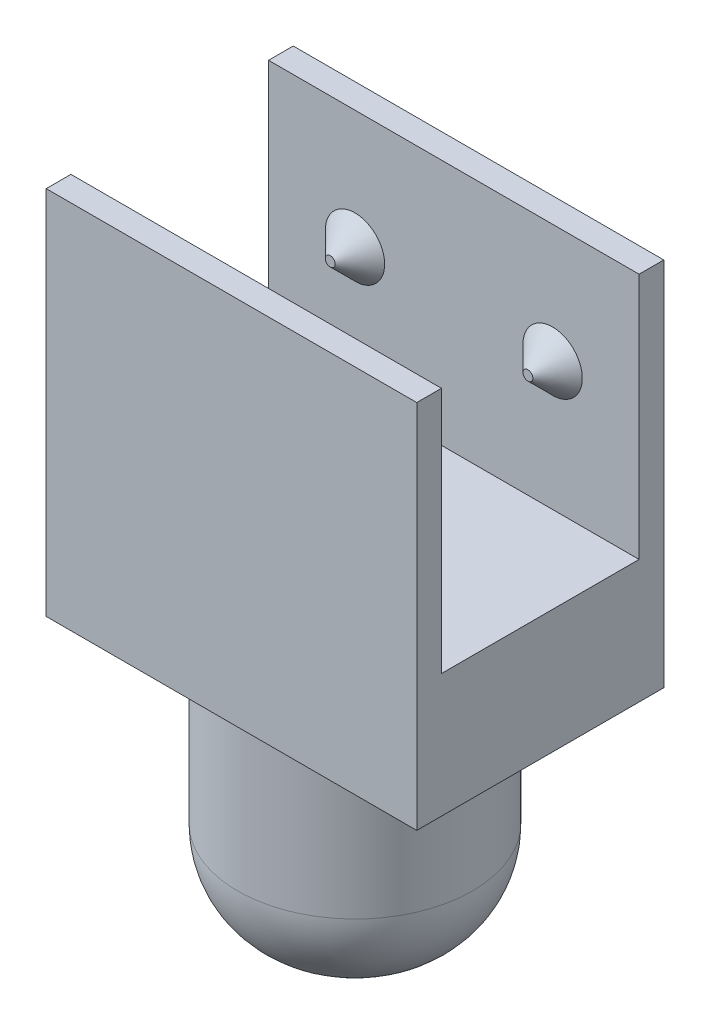
ISO-10303-21;
HEADER;
FILE_DESCRIPTION(('STEP AP214'),'2;1');
FILE_NAME('part.step','',(''),(''),'','','');
FILE_SCHEMA(('AUTOMOTIVE_DESIGN { 1 0 10303 214 1 1 1 1 }'));
ENDSEC;
DATA;
#1=APPLICATION_CONTEXT('core data for automotive mechanical design processes');
#2=APPLICATION_PROTOCOL_DEFINITION('international standard','automotive_design',2000,#1);
#3=PRODUCT_CONTEXT('',#1,'mechanical');
#4=PRODUCT('Part','Part','',(#3));
#5=PRODUCT_RELATED_PRODUCT_CATEGORY('part','',(#4));
#6=PRODUCT_DEFINITION_FORMATION('','',#4);
#7=PRODUCT_DEFINITION_CONTEXT('part definition',#1,'design');
#8=PRODUCT_DEFINITION('design','',#6,#7);
#9=PRODUCT_DEFINITION_SHAPE('','',#8);
#10=(LENGTH_UNIT() NAMED_UNIT(*) SI_UNIT(.MILLI.,.METRE.));
#11=(NAMED_UNIT(*) PLANE_ANGLE_UNIT() SI_UNIT($,.RADIAN.));
#12=(NAMED_UNIT(*) SI_UNIT($,.STERADIAN.) SOLID_ANGLE_UNIT());
#13=UNCERTAINTY_MEASURE_WITH_UNIT(LENGTH_MEASURE(1.E-05),#10,'distance_accuracy_value','');
#14=(GEOMETRIC_REPRESENTATION_CONTEXT(3) GLOBAL_UNCERTAINTY_ASSIGNED_CONTEXT((#13)) GLOBAL_UNIT_ASSIGNED_CONTEXT((#10,
#11,#12)) REPRESENTATION_CONTEXT('',''));
#15=CARTESIAN_POINT('',(0.,0.,0.));
#16=DIRECTION('',(0.,0.,1.));
#17=DIRECTION('',(1.,0.,0.));
#18=AXIS2_PLACEMENT_3D('',#15,#16,#17);
#19=CARTESIAN_POINT('',(0.,-19.05,6.35));
#20=DIRECTION('',(1.,0.,0.));
#21=DIRECTION('',(0.,1.,0.));
#22=AXIS2_PLACEMENT_3D('',#19,#20,#21);
#23=PLANE('',#22);
#24=DIRECTION('',(0.,-1.,0.));
#25=VECTOR('',#24,1.);
#26=CARTESIAN_POINT('',(0.,0.,-5.08));
#27=LINE('',#26,#25);
#28=CARTESIAN_POINT('',(0.,0.,-5.08));
#29=VERTEX_POINT('',#28);
#30=CARTESIAN_POINT('',(0.,-12.7,-5.08));
#31=VERTEX_POINT('',#30);
#32=EDGE_CURVE('E128',#29,#31,#27,.T.);
#33=ORIENTED_EDGE('',*,*,#32,.F.);
#34=DIRECTION('',(0.,0.,-1.));
#35=VECTOR('',#34,1.);
#36=CARTESIAN_POINT('',(0.,0.,6.35));
#37=LINE('',#36,#35);
#38=CARTESIAN_POINT('',(0.,0.,-6.35));
#39=VERTEX_POINT('',#38);
#40=EDGE_CURVE('E87',#29,#39,#37,.T.);
#41=ORIENTED_EDGE('',*,*,#40,.T.);
#42=DIRECTION('',(0.,-1.,0.));
#43=VECTOR('',#42,1.);
#44=CARTESIAN_POINT('',(0.,-19.05,-6.35));
#45=LINE('',#44,#43);
#46=CARTESIAN_POINT('',(0.,-19.05,-6.35));
#47=VERTEX_POINT('',#46);
#48=EDGE_CURVE('E137',#39,#47,#45,.T.);
#49=ORIENTED_EDGE('',*,*,#48,.T.);
#50=DIRECTION('',(0.,0.,-1.));
#51=VECTOR('',#50,1.);
#52=CARTESIAN_POINT('',(0.,-19.05,6.35));
#53=LINE('',#52,#51);
#54=CARTESIAN_POINT('',(0.,-19.05,6.35));
#55=VERTEX_POINT('',#54);
#56=EDGE_CURVE('E165',#55,#47,#53,.T.);
#57=ORIENTED_EDGE('',*,*,#56,.F.);
#58=DIRECTION('',(0.,-1.,0.));
#59=VECTOR('',#58,1.);
#60=CARTESIAN_POINT('',(0.,-19.05,6.35));
#61=LINE('',#60,#59);
#62=CARTESIAN_POINT('',(0.,0.,6.35));
#63=VERTEX_POINT('',#62);
#64=EDGE_CURVE('E142',#63,#55,#61,.T.);
#65=ORIENTED_EDGE('',*,*,#64,.F.);
#66=CARTESIAN_POINT('',(0.,0.,5.08));
#67=VERTEX_POINT('',#66);
#68=EDGE_CURVE('E156',#63,#67,#37,.T.);
#69=ORIENTED_EDGE('',*,*,#68,.T.);
#70=DIRECTION('',(0.,-1.,0.));
#71=VECTOR('',#70,1.);
#72=CARTESIAN_POINT('',(0.,0.,5.08));
#73=LINE('',#72,#71);
#74=CARTESIAN_POINT('',(0.,-12.7,5.08));
#75=VERTEX_POINT('',#74);
#76=EDGE_CURVE('E56',#67,#75,#73,.T.);
#77=ORIENTED_EDGE('',*,*,#76,.T.);
#78=DIRECTION('',(0.,0.,1.));
#79=VECTOR('',#78,1.);
#80=CARTESIAN_POINT('',(0.,-12.7,-5.08));
#81=LINE('',#80,#79);
#82=EDGE_CURVE('E122',#31,#75,#81,.T.);
#83=ORIENTED_EDGE('',*,*,#82,.F.);
#84=EDGE_LOOP('',(#33,#41,#49,#57,#65,#69,#77,#83));
#85=FACE_BOUND('',#84,.T.);
#86=ADVANCED_FACE('F41',(#85),#23,.F.);
#87=CARTESIAN_POINT('',(19.05,0.,6.35));
#88=DIRECTION('',(-1.,0.,0.));
#89=DIRECTION('',(0.,-1.,0.));
#90=AXIS2_PLACEMENT_3D('',#87,#88,#89);
#91=PLANE('',#90);
#92=DIRECTION('',(0.,1.,0.));
#93=VECTOR('',#92,1.);
#94=CARTESIAN_POINT('',(19.05,-12.7,-5.08));
#95=LINE('',#94,#93);
#96=CARTESIAN_POINT('',(19.05,-12.7,-5.08));
#97=VERTEX_POINT('',#96);
#98=CARTESIAN_POINT('',(19.05,0.,-5.08));
#99=VERTEX_POINT('',#98);
#100=EDGE_CURVE('E127',#97,#99,#95,.T.);
#101=ORIENTED_EDGE('',*,*,#100,.F.);
#102=DIRECTION('',(0.,0.,1.));
#103=VECTOR('',#102,1.);
#104=CARTESIAN_POINT('',(19.05,-12.7,-5.08));
#105=LINE('',#104,#103);
#106=CARTESIAN_POINT('',(19.05,-12.7,5.08));
#107=VERTEX_POINT('',#106);
#108=EDGE_CURVE('E124',#97,#107,#105,.T.);
#109=ORIENTED_EDGE('',*,*,#108,.T.);
#110=DIRECTION('',(0.,1.,0.));
#111=VECTOR('',#110,1.);
#112=CARTESIAN_POINT('',(19.05,-12.7,5.08));
#113=LINE('',#112,#111);
#114=CARTESIAN_POINT('',(19.05,0.,5.08));
#115=VERTEX_POINT('',#114);
#116=EDGE_CURVE('E203',#107,#115,#113,.T.);
#117=ORIENTED_EDGE('',*,*,#116,.T.);
#118=DIRECTION('',(0.,0.,-1.));
#119=VECTOR('',#118,1.);
#120=CARTESIAN_POINT('',(19.05,0.,6.35));
#121=LINE('',#120,#119);
#122=CARTESIAN_POINT('',(19.05,0.,6.35));
#123=VERTEX_POINT('',#122);
#124=EDGE_CURVE('E159',#123,#115,#121,.T.);
#125=ORIENTED_EDGE('',*,*,#124,.F.);
#126=DIRECTION('',(0.,1.,0.));
#127=VECTOR('',#126,1.);
#128=CARTESIAN_POINT('',(19.05,0.,6.35));
#129=LINE('',#128,#127);
#130=CARTESIAN_POINT('',(19.05,-19.05,6.35));
#131=VERTEX_POINT('',#130);
#132=EDGE_CURVE('E146',#131,#123,#129,.T.);
#133=ORIENTED_EDGE('',*,*,#132,.F.);
#134=DIRECTION('',(0.,0.,-1.));
#135=VECTOR('',#134,1.);
#136=CARTESIAN_POINT('',(19.05,-19.05,6.35));
#137=LINE('',#136,#135);
#138=CARTESIAN_POINT('',(19.05,-19.05,-6.35));
#139=VERTEX_POINT('',#138);
#140=EDGE_CURVE('E162',#131,#139,#137,.T.);
#141=ORIENTED_EDGE('',*,*,#140,.T.);
#142=DIRECTION('',(0.,1.,0.));
#143=VECTOR('',#142,1.);
#144=CARTESIAN_POINT('',(19.05,0.,-6.35));
#145=LINE('',#144,#143);
#146=CARTESIAN_POINT('',(19.05,0.,-6.35));
#147=VERTEX_POINT('',#146);
#148=EDGE_CURVE('E152',#139,#147,#145,.T.);
#149=ORIENTED_EDGE('',*,*,#148,.T.);
#150=EDGE_CURVE('E158',#99,#147,#121,.T.);
#151=ORIENTED_EDGE('',*,*,#150,.F.);
#152=EDGE_LOOP('',(#101,#109,#117,#125,#133,#141,#149,#151));
#153=FACE_BOUND('',#152,.T.);
#154=ADVANCED_FACE('F215',(#153),#91,.F.);
#155=CARTESIAN_POINT('',(0.,0.,6.35));
#156=DIRECTION('',(0.,-1.,0.));
#157=DIRECTION('',(1.,0.,0.));
#158=AXIS2_PLACEMENT_3D('',#155,#156,#157);
#159=PLANE('',#158);
#160=DIRECTION('',(-1.,0.,0.));
#161=VECTOR('',#160,1.);
#162=CARTESIAN_POINT('',(19.05,0.,-5.08));
#163=LINE('',#162,#161);
#164=EDGE_CURVE('E132',#99,#29,#163,.T.);
#165=ORIENTED_EDGE('',*,*,#164,.F.);
#166=ORIENTED_EDGE('',*,*,#150,.T.);
#167=DIRECTION('',(-1.,0.,0.));
#168=VECTOR('',#167,1.);
#169=CARTESIAN_POINT('',(0.,0.,-6.35));
#170=LINE('',#169,#168);
#171=EDGE_CURVE('E144',#147,#39,#170,.T.);
#172=ORIENTED_EDGE('',*,*,#171,.T.);
#173=ORIENTED_EDGE('',*,*,#40,.F.);
#174=EDGE_LOOP('',(#165,#166,#172,#173));
#175=FACE_BOUND('',#174,.T.);
#176=ADVANCED_FACE('F237',(#175),#159,.F.);
#177=CARTESIAN_POINT('',(19.05,-19.05,6.35));
#178=DIRECTION('',(0.,1.,0.));
#179=DIRECTION('',(-1.,0.,0.));
#180=AXIS2_PLACEMENT_3D('',#177,#178,#179);
#181=PLANE('',#180);
#182=CARTESIAN_POINT('',(9.525,-19.05,0.));
#183=DIRECTION('',(0.,-1.,0.));
#184=DIRECTION('',(1.,0.,0.));
#185=AXIS2_PLACEMENT_3D('',#182,#183,#184);
#186=CIRCLE('',#185,6.0325);
#187=CARTESIAN_POINT('',(15.5575,-19.05,0.));
#188=VERTEX_POINT('',#187);
#189=EDGE_CURVE('E178',#188,#188,#186,.T.);
#190=ORIENTED_EDGE('',*,*,#189,.F.);
#191=EDGE_LOOP('',(#190));
#192=FACE_BOUND('',#191,.T.);
#193=DIRECTION('',(1.,0.,0.));
#194=VECTOR('',#193,1.);
#195=CARTESIAN_POINT('',(19.05,-19.05,-6.35));
#196=LINE('',#195,#194);
#197=EDGE_CURVE('E150',#47,#139,#196,.T.);
#198=ORIENTED_EDGE('',*,*,#197,.T.);
#199=ORIENTED_EDGE('',*,*,#140,.F.);
#200=DIRECTION('',(1.,0.,0.));
#201=VECTOR('',#200,1.);
#202=CARTESIAN_POINT('',(19.05,-19.05,6.35));
#203=LINE('',#202,#201);
#204=EDGE_CURVE('E95',#55,#131,#203,.T.);
#205=ORIENTED_EDGE('',*,*,#204,.F.);
#206=ORIENTED_EDGE('',*,*,#56,.T.);
#207=EDGE_LOOP('',(#198,#199,#205,#206));
#208=FACE_BOUND('',#207,.T.);
#209=ADVANCED_FACE('F212',(#192,#208),#181,.F.);
#210=ORIENTED_EDGE('',*,*,#124,.T.);
#211=DIRECTION('',(-1.,0.,0.));
#212=VECTOR('',#211,1.);
#213=CARTESIAN_POINT('',(19.05,0.,5.08));
#214=LINE('',#213,#212);
#215=EDGE_CURVE('E133',#115,#67,#214,.T.);
#216=ORIENTED_EDGE('',*,*,#215,.T.);
#217=ORIENTED_EDGE('',*,*,#68,.F.);
#218=DIRECTION('',(-1.,0.,0.));
#219=VECTOR('',#218,1.);
#220=CARTESIAN_POINT('',(0.,0.,6.35));
#221=LINE('',#220,#219);
#222=EDGE_CURVE('E65',#123,#63,#221,.T.);
#223=ORIENTED_EDGE('',*,*,#222,.F.);
#224=EDGE_LOOP('',(#210,#216,#217,#223));
#225=FACE_BOUND('',#224,.T.);
#226=ADVANCED_FACE('F206',(#225),#159,.F.);
#227=CARTESIAN_POINT('',(0.,0.,6.35));
#228=DIRECTION('',(0.,0.,-1.));
#229=DIRECTION('',(-1.,0.,0.));
#230=AXIS2_PLACEMENT_3D('',#227,#228,#229);
#231=PLANE('',#230);
#232=ORIENTED_EDGE('',*,*,#64,.T.);
#233=ORIENTED_EDGE('',*,*,#204,.T.);
#234=ORIENTED_EDGE('',*,*,#132,.T.);
#235=ORIENTED_EDGE('',*,*,#222,.T.);
#236=EDGE_LOOP('',(#232,#233,#234,#235));
#237=FACE_BOUND('',#236,.T.);
#238=ADVANCED_FACE('F210',(#237),#231,.F.);
#239=CARTESIAN_POINT('',(0.,0.,-6.35));
#240=DIRECTION('',(0.,0.,-1.));
#241=DIRECTION('',(-1.,0.,0.));
#242=AXIS2_PLACEMENT_3D('',#239,#240,#241);
#243=PLANE('',#242);
#244=ORIENTED_EDGE('',*,*,#48,.F.);
#245=ORIENTED_EDGE('',*,*,#171,.F.);
#246=ORIENTED_EDGE('',*,*,#148,.F.);
#247=ORIENTED_EDGE('',*,*,#197,.F.);
#248=EDGE_LOOP('',(#244,#245,#246,#247));
#249=FACE_BOUND('',#248,.T.);
#250=ADVANCED_FACE('F424',(#249),#243,.T.);
#251=CARTESIAN_POINT('',(0.,-12.7,-5.08));
#252=DIRECTION('',(0.,-1.,0.));
#253=DIRECTION('',(1.,0.,0.));
#254=AXIS2_PLACEMENT_3D('',#251,#252,#253);
#255=PLANE('',#254);
#256=DIRECTION('',(1.,0.,0.));
#257=VECTOR('',#256,1.);
#258=CARTESIAN_POINT('',(0.,-12.7,5.08));
#259=LINE('',#258,#257);
#260=EDGE_CURVE('E201',#75,#107,#259,.T.);
#261=ORIENTED_EDGE('',*,*,#260,.T.);
#262=ORIENTED_EDGE('',*,*,#108,.F.);
#263=DIRECTION('',(1.,0.,0.));
#264=VECTOR('',#263,1.);
#265=CARTESIAN_POINT('',(0.,-12.7,-5.08));
#266=LINE('',#265,#264);
#267=EDGE_CURVE('E117',#31,#97,#266,.T.);
#268=ORIENTED_EDGE('',*,*,#267,.F.);
#269=ORIENTED_EDGE('',*,*,#82,.T.);
#270=EDGE_LOOP('',(#261,#262,#268,#269));
#271=FACE_BOUND('',#270,.T.);
#272=ADVANCED_FACE('F120',(#271),#255,.F.);
#273=CARTESIAN_POINT('',(0.,0.,-5.08));
#274=DIRECTION('',(0.,0.,1.));
#275=DIRECTION('',(1.,0.,0.));
#276=AXIS2_PLACEMENT_3D('',#273,#274,#275);
#277=PLANE('',#276);
#278=CARTESIAN_POINT('',(4.445,-6.096,-5.08));
#279=DIRECTION('',(0.,0.,1.));
#280=DIRECTION('',(1.,0.,0.));
#281=AXIS2_PLACEMENT_3D('',#278,#279,#280);
#282=CIRCLE('',#281,1.524);
#283=CARTESIAN_POINT('',(2.921,-6.096,-5.08));
#284=VERTEX_POINT('',#283);
#285=EDGE_CURVE('E193',#284,#284,#282,.T.);
#286=ORIENTED_EDGE('',*,*,#285,.F.);
#287=EDGE_LOOP('',(#286));
#288=FACE_BOUND('',#287,.T.);
#289=CARTESIAN_POINT('',(14.605,-6.09599999999999,-5.08));
#290=DIRECTION('',(0.,0.,1.));
#291=DIRECTION('',(1.,0.,0.));
#292=AXIS2_PLACEMENT_3D('',#289,#290,#291);
#293=CIRCLE('',#292,1.524);
#294=CARTESIAN_POINT('',(13.081,-6.09599999999999,-5.08));
#295=VERTEX_POINT('',#294);
#296=EDGE_CURVE('E196',#295,#295,#293,.T.);
#297=ORIENTED_EDGE('',*,*,#296,.F.);
#298=EDGE_LOOP('',(#297));
#299=FACE_BOUND('',#298,.T.);
#300=ORIENTED_EDGE('',*,*,#32,.T.);
#301=ORIENTED_EDGE('',*,*,#267,.T.);
#302=ORIENTED_EDGE('',*,*,#100,.T.);
#303=ORIENTED_EDGE('',*,*,#164,.T.);
#304=EDGE_LOOP('',(#300,#301,#302,#303));
#305=FACE_BOUND('',#304,.T.);
#306=ADVANCED_FACE('F130',(#288,#299,#305),#277,.T.);
#307=CARTESIAN_POINT('',(0.,0.,5.08));
#308=DIRECTION('',(0.,0.,1.));
#309=DIRECTION('',(1.,0.,0.));
#310=AXIS2_PLACEMENT_3D('',#307,#308,#309);
#311=PLANE('',#310);
#312=CARTESIAN_POINT('',(4.445,-6.096,5.08));
#313=DIRECTION('',(0.,0.,1.));
#314=DIRECTION('',(1.,0.,0.));
#315=AXIS2_PLACEMENT_3D('',#312,#313,#314);
#316=CIRCLE('',#315,1.524);
#317=CARTESIAN_POINT('',(5.96899999999999,-6.096,5.08));
#318=VERTEX_POINT('',#317);
#319=EDGE_CURVE('E187',#318,#318,#316,.T.);
#320=ORIENTED_EDGE('',*,*,#319,.T.);
#321=EDGE_LOOP('',(#320));
#322=FACE_BOUND('',#321,.T.);
#323=CARTESIAN_POINT('',(14.605,-6.09599999999999,5.08));
#324=DIRECTION('',(0.,0.,1.));
#325=DIRECTION('',(1.,0.,0.));
#326=AXIS2_PLACEMENT_3D('',#323,#324,#325);
#327=CIRCLE('',#326,1.524);
#328=CARTESIAN_POINT('',(16.129,-6.09599999999999,5.08));
#329=VERTEX_POINT('',#328);
#330=EDGE_CURVE('E190',#329,#329,#327,.T.);
#331=ORIENTED_EDGE('',*,*,#330,.T.);
#332=EDGE_LOOP('',(#331));
#333=FACE_BOUND('',#332,.T.);
#334=ORIENTED_EDGE('',*,*,#76,.F.);
#335=ORIENTED_EDGE('',*,*,#215,.F.);
#336=ORIENTED_EDGE('',*,*,#116,.F.);
#337=ORIENTED_EDGE('',*,*,#260,.F.);
#338=EDGE_LOOP('',(#334,#335,#336,#337));
#339=FACE_BOUND('',#338,.T.);
#340=ADVANCED_FACE('F216',(#322,#333,#339),#311,.F.);
#341=CARTESIAN_POINT('',(14.605,-6.09599999999999,-3.81));
#342=DIRECTION('',(0.,0.,1.));
#343=DIRECTION('',(1.,0.,0.));
#344=AXIS2_PLACEMENT_3D('',#341,#342,#343);
#345=PLANE('',#344);
#346=CARTESIAN_POINT('',(14.605,-6.09599999999999,-3.81));
#347=DIRECTION('',(0.,0.,1.));
#348=DIRECTION('',(1.,0.,0.));
#349=AXIS2_PLACEMENT_3D('',#346,#347,#348);
#350=CIRCLE('',#349,0.254000000000001);
#351=CARTESIAN_POINT('',(14.351,-6.09599999999999,-3.81));
#352=VERTEX_POINT('',#351);
#353=EDGE_CURVE('E170',#352,#352,#350,.T.);
#354=ORIENTED_EDGE('',*,*,#353,.T.);
#355=EDGE_LOOP('',(#354));
#356=FACE_BOUND('',#355,.T.);
#357=ADVANCED_FACE('F218',(#356),#345,.T.);
#358=CARTESIAN_POINT('',(4.445,-6.096,-3.81));
#359=DIRECTION('',(0.,0.,1.));
#360=DIRECTION('',(1.,0.,0.));
#361=AXIS2_PLACEMENT_3D('',#358,#359,#360);
#362=PLANE('',#361);
#363=CARTESIAN_POINT('',(4.445,-6.096,-3.81));
#364=DIRECTION('',(0.,0.,1.));
#365=DIRECTION('',(1.,0.,0.));
#366=AXIS2_PLACEMENT_3D('',#363,#364,#365);
#367=CIRCLE('',#366,0.253999999999997);
#368=CARTESIAN_POINT('',(4.191,-6.096,-3.81));
#369=VERTEX_POINT('',#368);
#370=EDGE_CURVE('E167',#369,#369,#367,.T.);
#371=ORIENTED_EDGE('',*,*,#370,.T.);
#372=EDGE_LOOP('',(#371));
#373=FACE_BOUND('',#372,.T.);
#374=ADVANCED_FACE('F225',(#373),#362,.T.);
#375=CARTESIAN_POINT('',(4.445,-6.096,-3.81));
#376=DIRECTION('',(0.,0.,-1.));
#377=DIRECTION('',(-1.,0.,0.));
#378=AXIS2_PLACEMENT_3D('',#375,#376,#377);
#379=CONICAL_SURFACE('',#378,0.253999999999997,0.785398163397446);
#380=CARTESIAN_POINT('',(2.921,-6.096,-5.08));
#381=CARTESIAN_POINT('',(2.93422916666667,-6.096,-5.06677083333333));
#382=CARTESIAN_POINT('',(2.94745833333334,-6.096,-5.05354166666667));
#383=CARTESIAN_POINT('',(2.97391666666667,-6.096,-5.02708333333333));
#384=CARTESIAN_POINT('',(2.98714583333334,-6.096,-5.01385416666667));
#385=CARTESIAN_POINT('',(3.01360416666667,-6.096,-4.98739583333333));
#386=CARTESIAN_POINT('',(3.02683333333334,-6.096,-4.97416666666667));
#387=CARTESIAN_POINT('',(3.05329166666667,-6.096,-4.94770833333333));
#388=CARTESIAN_POINT('',(3.06652083333334,-6.096,-4.93447916666667));
#389=CARTESIAN_POINT('',(3.09297916666667,-6.096,-4.90802083333333));
#390=CARTESIAN_POINT('',(3.10620833333334,-6.096,-4.89479166666667));
#391=CARTESIAN_POINT('',(3.13266666666667,-6.096,-4.86833333333333));
#392=CARTESIAN_POINT('',(3.14589583333334,-6.096,-4.85510416666667));
#393=CARTESIAN_POINT('',(3.17235416666667,-6.096,-4.82864583333333));
#394=CARTESIAN_POINT('',(3.18558333333334,-6.096,-4.81541666666667));
#395=CARTESIAN_POINT('',(3.21204166666667,-6.096,-4.78895833333333));
#396=CARTESIAN_POINT('',(3.22527083333334,-6.096,-4.77572916666667));
#397=CARTESIAN_POINT('',(3.25172916666667,-6.096,-4.74927083333333));
#398=CARTESIAN_POINT('',(3.26495833333334,-6.096,-4.73604166666667));
#399=CARTESIAN_POINT('',(3.29141666666667,-6.096,-4.70958333333333));
#400=CARTESIAN_POINT('',(3.30464583333334,-6.096,-4.69635416666667));
#401=CARTESIAN_POINT('',(3.33110416666667,-6.096,-4.66989583333333));
#402=CARTESIAN_POINT('',(3.34433333333334,-6.096,-4.65666666666667));
#403=CARTESIAN_POINT('',(3.37079166666667,-6.096,-4.63020833333333));
#404=CARTESIAN_POINT('',(3.38402083333334,-6.096,-4.61697916666667));
#405=CARTESIAN_POINT('',(3.41047916666667,-6.096,-4.59052083333333));
#406=CARTESIAN_POINT('',(3.42370833333334,-6.096,-4.57729166666667));
#407=CARTESIAN_POINT('',(3.45016666666667,-6.096,-4.55083333333333));
#408=CARTESIAN_POINT('',(3.46339583333334,-6.096,-4.53760416666667));
#409=CARTESIAN_POINT('',(3.48985416666667,-6.096,-4.51114583333333));
#410=CARTESIAN_POINT('',(3.50308333333334,-6.096,-4.49791666666667));
#411=CARTESIAN_POINT('',(3.52954166666667,-6.096,-4.47145833333333));
#412=CARTESIAN_POINT('',(3.54277083333334,-6.096,-4.45822916666667));
#413=CARTESIAN_POINT('',(3.56922916666667,-6.096,-4.43177083333333));
#414=CARTESIAN_POINT('',(3.58245833333334,-6.096,-4.41854166666667));
#415=CARTESIAN_POINT('',(3.60891666666667,-6.096,-4.39208333333333));
#416=CARTESIAN_POINT('',(3.62214583333333,-6.096,-4.37885416666667));
#417=CARTESIAN_POINT('',(3.64860416666667,-6.096,-4.35239583333333));
#418=CARTESIAN_POINT('',(3.66183333333333,-6.096,-4.33916666666667));
#419=CARTESIAN_POINT('',(3.68829166666667,-6.096,-4.31270833333333));
#420=CARTESIAN_POINT('',(3.70152083333333,-6.096,-4.29947916666667));
#421=CARTESIAN_POINT('',(3.72797916666667,-6.096,-4.27302083333333));
#422=CARTESIAN_POINT('',(3.74120833333333,-6.096,-4.25979166666667));
#423=CARTESIAN_POINT('',(3.76766666666667,-6.096,-4.23333333333333));
#424=CARTESIAN_POINT('',(3.78089583333333,-6.096,-4.22010416666667));
#425=CARTESIAN_POINT('',(3.80735416666667,-6.096,-4.19364583333333));
#426=CARTESIAN_POINT('',(3.82058333333333,-6.096,-4.18041666666667));
#427=CARTESIAN_POINT('',(3.84704166666667,-6.096,-4.15395833333333));
#428=CARTESIAN_POINT('',(3.86027083333333,-6.096,-4.14072916666667));
#429=CARTESIAN_POINT('',(3.88672916666667,-6.096,-4.11427083333333));
#430=CARTESIAN_POINT('',(3.89995833333333,-6.096,-4.10104166666667));
#431=CARTESIAN_POINT('',(3.92641666666667,-6.096,-4.07458333333333));
#432=CARTESIAN_POINT('',(3.93964583333333,-6.096,-4.06135416666667));
#433=CARTESIAN_POINT('',(3.96610416666667,-6.096,-4.03489583333333));
#434=CARTESIAN_POINT('',(3.97933333333333,-6.096,-4.02166666666667));
#435=CARTESIAN_POINT('',(4.00579166666667,-6.096,-3.99520833333333));
#436=CARTESIAN_POINT('',(4.01902083333333,-6.096,-3.98197916666667));
#437=CARTESIAN_POINT('',(4.04547916666667,-6.096,-3.95552083333333));
#438=CARTESIAN_POINT('',(4.05870833333333,-6.096,-3.94229166666667));
#439=CARTESIAN_POINT('',(4.08516666666667,-6.096,-3.91583333333333));
#440=CARTESIAN_POINT('',(4.09839583333333,-6.096,-3.90260416666667));
#441=CARTESIAN_POINT('',(4.12485416666667,-6.096,-3.87614583333333));
#442=CARTESIAN_POINT('',(4.13808333333333,-6.096,-3.86291666666667));
#443=CARTESIAN_POINT('',(4.16454166666667,-6.096,-3.83645833333333));
#444=CARTESIAN_POINT('',(4.17777083333333,-6.096,-3.82322916666667));
#445=CARTESIAN_POINT('',(4.191,-6.096,-3.81));
#446=B_SPLINE_CURVE_WITH_KNOTS('',3,(#380,#381,#382,#383,#384,#385,#386,#387,#388,#389,#390,
#391,#392,#393,#394,#395,#396,#397,#398,#399,#400,#401,#402,#403,#404,#405,#406,#407,#408,#409,
#410,#411,#412,#413,#414,#415,#416,#417,#418,#419,#420,#421,#422,#423,#424,#425,#426,#427,#428,
#429,#430,#431,#432,#433,#434,#435,#436,#437,#438,#439,#440,#441,#442,#443,#444,#445),
.UNSPECIFIED.,.F.,.F.,(4,2,2,2,2,2,2,2,2,2,2,2,2,2,2,2,2,2,2,2,2,2,2,2,2,2,2,2,2,2,2,2,4),(0.,
0.0561266007566825,0.112253201513364,0.168379802270046,0.224506403026729,0.280633003783411,
0.336759604540093,0.392886205296775,0.449012806053457,0.505139406810139,0.561266007566821,
0.617392608323503,0.673519209080186,0.729645809836868,0.78577241059355,0.841899011350232,
0.898025612106914,0.954152212863596,1.01027881362028,1.06640541437696,1.12253201513364,
1.17865861589032,1.23478521664701,1.29091181740369,1.34703841816037,1.40316501891705,
1.45929161967373,1.51541822043042,1.5715448211871,1.62767142194378,1.68379802270046,
1.73992462345715,1.79605122421383),.UNSPECIFIED.);
#447=EDGE_CURVE('BSEAM242',#284,#369,#446,.T.);
#448=ORIENTED_EDGE('',*,*,#285,.T.);
#449=ORIENTED_EDGE('',*,*,#370,.F.);
#450=ORIENTED_EDGE('',*,*,#447,.T.);
#451=ORIENTED_EDGE('',*,*,#447,.F.);
#452=EDGE_LOOP('',(#448,#450,#449,#451));
#453=FACE_BOUND('',#452,.T.);
#454=ADVANCED_FACE('F242',(#453),#379,.T.);
#455=CARTESIAN_POINT('',(14.605,-6.09599999999999,-3.81));
#456=DIRECTION('',(0.,0.,-1.));
#457=DIRECTION('',(-1.,0.,0.));
#458=AXIS2_PLACEMENT_3D('',#455,#456,#457);
#459=CONICAL_SURFACE('',#458,0.254000000000001,0.785398163397447);
#460=CARTESIAN_POINT('',(13.081,-6.09599999999999,-5.08));
#461=CARTESIAN_POINT('',(13.0942291666667,-6.09599999999999,-5.06677083333333));
#462=CARTESIAN_POINT('',(13.1074583333333,-6.09599999999999,-5.05354166666667));
#463=CARTESIAN_POINT('',(13.1339166666667,-6.09599999999999,-5.02708333333333));
#464=CARTESIAN_POINT('',(13.1471458333333,-6.09599999999999,-5.01385416666667));
#465=CARTESIAN_POINT('',(13.1736041666667,-6.09599999999999,-4.98739583333333));
#466=CARTESIAN_POINT('',(13.1868333333333,-6.09599999999999,-4.97416666666667));
#467=CARTESIAN_POINT('',(13.2132916666667,-6.09599999999999,-4.94770833333333));
#468=CARTESIAN_POINT('',(13.2265208333333,-6.09599999999999,-4.93447916666667));
#469=CARTESIAN_POINT('',(13.2529791666667,-6.09599999999999,-4.90802083333333));
#470=CARTESIAN_POINT('',(13.2662083333333,-6.09599999999999,-4.89479166666667));
#471=CARTESIAN_POINT('',(13.2926666666667,-6.09599999999999,-4.86833333333333));
#472=CARTESIAN_POINT('',(13.3058958333333,-6.09599999999999,-4.85510416666667));
#473=CARTESIAN_POINT('',(13.3323541666667,-6.09599999999999,-4.82864583333333));
#474=CARTESIAN_POINT('',(13.3455833333333,-6.09599999999999,-4.81541666666667));
#475=CARTESIAN_POINT('',(13.3720416666667,-6.09599999999999,-4.78895833333333));
#476=CARTESIAN_POINT('',(13.3852708333333,-6.09599999999999,-4.77572916666667));
#477=CARTESIAN_POINT('',(13.4117291666667,-6.09599999999999,-4.74927083333333));
#478=CARTESIAN_POINT('',(13.4249583333333,-6.09599999999999,-4.73604166666667));
#479=CARTESIAN_POINT('',(13.4514166666667,-6.09599999999999,-4.70958333333333));
#480=CARTESIAN_POINT('',(13.4646458333333,-6.09599999999999,-4.69635416666667));
#481=CARTESIAN_POINT('',(13.4911041666667,-6.09599999999999,-4.66989583333333));
#482=CARTESIAN_POINT('',(13.5043333333333,-6.09599999999999,-4.65666666666667));
#483=CARTESIAN_POINT('',(13.5307916666667,-6.09599999999999,-4.63020833333333));
#484=CARTESIAN_POINT('',(13.5440208333333,-6.09599999999999,-4.61697916666667));
#485=CARTESIAN_POINT('',(13.5704791666667,-6.09599999999999,-4.59052083333333));
#486=CARTESIAN_POINT('',(13.5837083333333,-6.09599999999999,-4.57729166666667));
#487=CARTESIAN_POINT('',(13.6101666666667,-6.09599999999999,-4.55083333333333));
#488=CARTESIAN_POINT('',(13.6233958333333,-6.09599999999999,-4.53760416666667));
#489=CARTESIAN_POINT('',(13.6498541666667,-6.09599999999999,-4.51114583333333));
#490=CARTESIAN_POINT('',(13.6630833333333,-6.09599999999999,-4.49791666666667));
#491=CARTESIAN_POINT('',(13.6895416666667,-6.09599999999999,-4.47145833333333));
#492=CARTESIAN_POINT('',(13.7027708333333,-6.09599999999999,-4.45822916666667));
#493=CARTESIAN_POINT('',(13.7292291666667,-6.09599999999999,-4.43177083333333));
#494=CARTESIAN_POINT('',(13.7424583333333,-6.09599999999999,-4.41854166666667));
#495=CARTESIAN_POINT('',(13.7689166666667,-6.09599999999999,-4.39208333333333));
#496=CARTESIAN_POINT('',(13.7821458333333,-6.09599999999999,-4.37885416666667));
#497=CARTESIAN_POINT('',(13.8086041666667,-6.09599999999999,-4.35239583333333));
#498=CARTESIAN_POINT('',(13.8218333333333,-6.09599999999999,-4.33916666666667));
#499=CARTESIAN_POINT('',(13.8482916666667,-6.09599999999999,-4.31270833333333));
#500=CARTESIAN_POINT('',(13.8615208333333,-6.09599999999999,-4.29947916666667));
#501=CARTESIAN_POINT('',(13.8879791666667,-6.09599999999999,-4.27302083333333));
#502=CARTESIAN_POINT('',(13.9012083333333,-6.09599999999999,-4.25979166666667));
#503=CARTESIAN_POINT('',(13.9276666666667,-6.09599999999999,-4.23333333333333));
#504=CARTESIAN_POINT('',(13.9408958333333,-6.09599999999999,-4.22010416666667));
#505=CARTESIAN_POINT('',(13.9673541666667,-6.09599999999999,-4.19364583333333));
#506=CARTESIAN_POINT('',(13.9805833333333,-6.09599999999999,-4.18041666666667));
#507=CARTESIAN_POINT('',(14.0070416666667,-6.09599999999999,-4.15395833333333));
#508=CARTESIAN_POINT('',(14.0202708333333,-6.09599999999999,-4.14072916666667));
#509=CARTESIAN_POINT('',(14.0467291666667,-6.09599999999999,-4.11427083333333));
#510=CARTESIAN_POINT('',(14.0599583333333,-6.09599999999999,-4.10104166666667));
#511=CARTESIAN_POINT('',(14.0864166666667,-6.09599999999999,-4.07458333333333));
#512=CARTESIAN_POINT('',(14.0996458333333,-6.09599999999999,-4.06135416666667));
#513=CARTESIAN_POINT('',(14.1261041666667,-6.09599999999999,-4.03489583333333));
#514=CARTESIAN_POINT('',(14.1393333333333,-6.09599999999999,-4.02166666666667));
#515=CARTESIAN_POINT('',(14.1657916666667,-6.09599999999999,-3.99520833333333));
#516=CARTESIAN_POINT('',(14.1790208333333,-6.09599999999999,-3.98197916666667));
#517=CARTESIAN_POINT('',(14.2054791666667,-6.09599999999999,-3.95552083333333));
#518=CARTESIAN_POINT('',(14.2187083333333,-6.09599999999999,-3.94229166666667));
#519=CARTESIAN_POINT('',(14.2451666666667,-6.09599999999999,-3.91583333333333));
#520=CARTESIAN_POINT('',(14.2583958333333,-6.09599999999999,-3.90260416666667));
#521=CARTESIAN_POINT('',(14.2848541666667,-6.09599999999999,-3.87614583333333));
#522=CARTESIAN_POINT('',(14.2980833333333,-6.09599999999999,-3.86291666666667));
#523=CARTESIAN_POINT('',(14.3245416666667,-6.09599999999999,-3.83645833333333));
#524=CARTESIAN_POINT('',(14.3377708333333,-6.09599999999999,-3.82322916666667));
#525=CARTESIAN_POINT('',(14.351,-6.09599999999999,-3.81));
#526=B_SPLINE_CURVE_WITH_KNOTS('',3,(#460,#461,#462,#463,#464,#465,#466,#467,#468,#469,#470,
#471,#472,#473,#474,#475,#476,#477,#478,#479,#480,#481,#482,#483,#484,#485,#486,#487,#488,#489,
#490,#491,#492,#493,#494,#495,#496,#497,#498,#499,#500,#501,#502,#503,#504,#505,#506,#507,#508,
#509,#510,#511,#512,#513,#514,#515,#516,#517,#518,#519,#520,#521,#522,#523,#524,#525),
.UNSPECIFIED.,.F.,.F.,(4,2,2,2,2,2,2,2,2,2,2,2,2,2,2,2,2,2,2,2,2,2,2,2,2,2,2,2,2,2,2,2,4),(0.,
0.0561266007566825,0.112253201513364,0.168379802270046,0.224506403026729,0.280633003783411,
0.336759604540093,0.392886205296775,0.449012806053457,0.505139406810139,0.561266007566821,
0.617392608323503,0.673519209080187,0.729645809836868,0.78577241059355,0.841899011350232,
0.898025612106915,0.954152212863597,1.01027881362028,1.06640541437696,1.12253201513364,
1.17865861589032,1.23478521664701,1.29091181740369,1.34703841816037,1.40316501891705,
1.45929161967374,1.51541822043042,1.5715448211871,1.62767142194378,1.68379802270046,
1.73992462345715,1.79605122421383),.UNSPECIFIED.);
#527=EDGE_CURVE('BSEAM248',#295,#352,#526,.T.);
#528=ORIENTED_EDGE('',*,*,#296,.T.);
#529=ORIENTED_EDGE('',*,*,#353,.F.);
#530=ORIENTED_EDGE('',*,*,#527,.T.);
#531=ORIENTED_EDGE('',*,*,#527,.F.);
#532=EDGE_LOOP('',(#528,#530,#529,#531));
#533=FACE_BOUND('',#532,.T.);
#534=ADVANCED_FACE('F248',(#533),#459,.T.);
#535=CARTESIAN_POINT('',(14.605,-6.09599999999999,3.81));
#536=DIRECTION('',(0.,0.,-1.));
#537=DIRECTION('',(1.,0.,0.));
#538=AXIS2_PLACEMENT_3D('',#535,#536,#537);
#539=PLANE('',#538);
#540=CARTESIAN_POINT('',(14.605,-6.09599999999999,3.81));
#541=DIRECTION('',(0.,0.,-1.));
#542=DIRECTION('',(-1.,0.,0.));
#543=AXIS2_PLACEMENT_3D('',#540,#541,#542);
#544=CIRCLE('',#543,0.253999999999994);
#545=CARTESIAN_POINT('',(14.859,-6.09599999999999,3.81));
#546=VERTEX_POINT('',#545);
#547=EDGE_CURVE('E176',#546,#546,#544,.T.);
#548=ORIENTED_EDGE('',*,*,#547,.T.);
#549=EDGE_LOOP('',(#548));
#550=FACE_BOUND('',#549,.T.);
#551=ADVANCED_FACE('F255',(#550),#539,.T.);
#552=CARTESIAN_POINT('',(4.445,-6.096,3.81));
#553=DIRECTION('',(0.,0.,-1.));
#554=DIRECTION('',(1.,0.,0.));
#555=AXIS2_PLACEMENT_3D('',#552,#553,#554);
#556=PLANE('',#555);
#557=CARTESIAN_POINT('',(4.445,-6.096,3.81));
#558=DIRECTION('',(0.,0.,-1.));
#559=DIRECTION('',(-1.,0.,0.));
#560=AXIS2_PLACEMENT_3D('',#557,#558,#559);
#561=CIRCLE('',#560,0.253999999999997);
#562=CARTESIAN_POINT('',(4.69899999999999,-6.096,3.81));
#563=VERTEX_POINT('',#562);
#564=EDGE_CURVE('E173',#563,#563,#561,.T.);
#565=ORIENTED_EDGE('',*,*,#564,.T.);
#566=EDGE_LOOP('',(#565));
#567=FACE_BOUND('',#566,.T.);
#568=ADVANCED_FACE('F263',(#567),#556,.T.);
#569=CARTESIAN_POINT('',(4.445,-6.096,5.08000000000001));
#570=DIRECTION('',(0.,0.,1.));
#571=DIRECTION('',(1.,0.,0.));
#572=AXIS2_PLACEMENT_3D('',#569,#570,#571);
#573=CONICAL_SURFACE('',#572,1.524,0.785398163397446);
#574=CARTESIAN_POINT('',(4.69899999999999,-6.096,3.81));
#575=CARTESIAN_POINT('',(4.71222916666666,-6.096,3.82322916666667));
#576=CARTESIAN_POINT('',(4.72545833333333,-6.096,3.83645833333333));
#577=CARTESIAN_POINT('',(4.75191666666666,-6.096,3.86291666666667));
#578=CARTESIAN_POINT('',(4.76514583333333,-6.096,3.87614583333333));
#579=CARTESIAN_POINT('',(4.79160416666666,-6.096,3.90260416666667));
#580=CARTESIAN_POINT('',(4.80483333333333,-6.096,3.91583333333333));
#581=CARTESIAN_POINT('',(4.83129166666666,-6.096,3.94229166666667));
#582=CARTESIAN_POINT('',(4.84452083333333,-6.096,3.95552083333333));
#583=CARTESIAN_POINT('',(4.87097916666666,-6.096,3.98197916666667));
#584=CARTESIAN_POINT('',(4.88420833333333,-6.096,3.99520833333333));
#585=CARTESIAN_POINT('',(4.91066666666666,-6.096,4.02166666666667));
#586=CARTESIAN_POINT('',(4.92389583333333,-6.096,4.03489583333333));
#587=CARTESIAN_POINT('',(4.95035416666666,-6.096,4.06135416666667));
#588=CARTESIAN_POINT('',(4.96358333333333,-6.096,4.07458333333333));
#589=CARTESIAN_POINT('',(4.99004166666666,-6.096,4.10104166666667));
#590=CARTESIAN_POINT('',(5.00327083333333,-6.096,4.11427083333333));
#591=CARTESIAN_POINT('',(5.02972916666666,-6.096,4.14072916666667));
#592=CARTESIAN_POINT('',(5.04295833333333,-6.096,4.15395833333333));
#593=CARTESIAN_POINT('',(5.06941666666666,-6.096,4.18041666666667));
#594=CARTESIAN_POINT('',(5.08264583333333,-6.096,4.19364583333333));
#595=CARTESIAN_POINT('',(5.10910416666666,-6.096,4.22010416666667));
#596=CARTESIAN_POINT('',(5.12233333333333,-6.096,4.23333333333333));
#597=CARTESIAN_POINT('',(5.14879166666666,-6.096,4.25979166666667));
#598=CARTESIAN_POINT('',(5.16202083333333,-6.096,4.27302083333333));
#599=CARTESIAN_POINT('',(5.18847916666666,-6.096,4.29947916666667));
#600=CARTESIAN_POINT('',(5.20170833333333,-6.096,4.31270833333333));
#601=CARTESIAN_POINT('',(5.22816666666666,-6.096,4.33916666666667));
#602=CARTESIAN_POINT('',(5.24139583333333,-6.096,4.35239583333333));
#603=CARTESIAN_POINT('',(5.26785416666666,-6.096,4.37885416666667));
#604=CARTESIAN_POINT('',(5.28108333333333,-6.096,4.39208333333333));
#605=CARTESIAN_POINT('',(5.30754166666666,-6.096,4.41854166666667));
#606=CARTESIAN_POINT('',(5.32077083333332,-6.096,4.43177083333333));
#607=CARTESIAN_POINT('',(5.34722916666666,-6.096,4.45822916666667));
#608=CARTESIAN_POINT('',(5.36045833333332,-6.096,4.47145833333333));
#609=CARTESIAN_POINT('',(5.38691666666666,-6.096,4.49791666666667));
#610=CARTESIAN_POINT('',(5.40014583333332,-6.096,4.51114583333333));
#611=CARTESIAN_POINT('',(5.42660416666666,-6.096,4.53760416666667));
#612=CARTESIAN_POINT('',(5.43983333333332,-6.096,4.55083333333333));
#613=CARTESIAN_POINT('',(5.46629166666666,-6.096,4.57729166666667));
#614=CARTESIAN_POINT('',(5.47952083333332,-6.096,4.59052083333333));
#615=CARTESIAN_POINT('',(5.50597916666666,-6.096,4.61697916666667));
#616=CARTESIAN_POINT('',(5.51920833333332,-6.096,4.63020833333333));
#617=CARTESIAN_POINT('',(5.54566666666666,-6.096,4.65666666666667));
#618=CARTESIAN_POINT('',(5.55889583333332,-6.096,4.66989583333333));
#619=CARTESIAN_POINT('',(5.58535416666666,-6.096,4.69635416666667));
#620=CARTESIAN_POINT('',(5.59858333333332,-6.096,4.70958333333333));
#621=CARTESIAN_POINT('',(5.62504166666666,-6.096,4.73604166666667));
#622=CARTESIAN_POINT('',(5.63827083333332,-6.096,4.74927083333333));
#623=CARTESIAN_POINT('',(5.66472916666666,-6.096,4.77572916666667));
#624=CARTESIAN_POINT('',(5.67795833333332,-6.096,4.78895833333333));
#625=CARTESIAN_POINT('',(5.70441666666666,-6.096,4.81541666666667));
#626=CARTESIAN_POINT('',(5.71764583333332,-6.096,4.82864583333333));
#627=CARTESIAN_POINT('',(5.74410416666666,-6.096,4.85510416666667));
#628=CARTESIAN_POINT('',(5.75733333333332,-6.096,4.86833333333333));
#629=CARTESIAN_POINT('',(5.78379166666666,-6.096,4.89479166666667));
#630=CARTESIAN_POINT('',(5.79702083333332,-6.096,4.90802083333333));
#631=CARTESIAN_POINT('',(5.82347916666666,-6.096,4.93447916666667));
#632=CARTESIAN_POINT('',(5.83670833333332,-6.096,4.94770833333333));
#633=CARTESIAN_POINT('',(5.86316666666666,-6.096,4.97416666666667));
#634=CARTESIAN_POINT('',(5.87639583333332,-6.096,4.98739583333333));
#635=CARTESIAN_POINT('',(5.90285416666666,-6.096,5.01385416666667));
#636=CARTESIAN_POINT('',(5.91608333333332,-6.096,5.02708333333333));
#637=CARTESIAN_POINT('',(5.94254166666666,-6.096,5.05354166666667));
#638=CARTESIAN_POINT('',(5.95577083333332,-6.096,5.06677083333333));
#639=CARTESIAN_POINT('',(5.96899999999999,-6.096,5.08));
#640=B_SPLINE_CURVE_WITH_KNOTS('',3,(#574,#575,#576,#577,#578,#579,#580,#581,#582,#583,#584,
#585,#586,#587,#588,#589,#590,#591,#592,#593,#594,#595,#596,#597,#598,#599,#600,#601,#602,#603,
#604,#605,#606,#607,#608,#609,#610,#611,#612,#613,#614,#615,#616,#617,#618,#619,#620,#621,#622,
#623,#624,#625,#626,#627,#628,#629,#630,#631,#632,#633,#634,#635,#636,#637,#638,#639),
.UNSPECIFIED.,.F.,.F.,(4,2,2,2,2,2,2,2,2,2,2,2,2,2,2,2,2,2,2,2,2,2,2,2,2,2,2,2,2,2,2,2,4),(0.,
0.0561266007566822,0.112253201513364,0.168379802270046,0.224506403026728,0.28063300378341,
0.336759604540092,0.392886205296774,0.449012806053456,0.505139406810139,0.561266007566821,
0.617392608323503,0.673519209080184,0.729645809836866,0.785772410593548,0.841899011350231,
0.898025612106913,0.954152212863595,1.01027881362028,1.06640541437696,1.12253201513364,
1.17865861589032,1.234785216647,1.29091181740369,1.34703841816037,1.40316501891705,
1.45929161967373,1.51541822043042,1.5715448211871,1.62767142194378,1.68379802270046,
1.73992462345714,1.79605122421383),.UNSPECIFIED.);
#641=EDGE_CURVE('BSEAM257',#563,#318,#640,.T.);
#642=ORIENTED_EDGE('',*,*,#564,.F.);
#643=ORIENTED_EDGE('',*,*,#319,.F.);
#644=ORIENTED_EDGE('',*,*,#641,.T.);
#645=ORIENTED_EDGE('',*,*,#641,.F.);
#646=EDGE_LOOP('',(#642,#644,#643,#645));
#647=FACE_BOUND('',#646,.T.);
#648=ADVANCED_FACE('F257',(#647),#573,.T.);
#649=CARTESIAN_POINT('',(14.605,-6.09599999999999,5.08000000000002));
#650=DIRECTION('',(0.,0.,1.));
#651=DIRECTION('',(1.,0.,0.));
#652=AXIS2_PLACEMENT_3D('',#649,#650,#651);
#653=CONICAL_SURFACE('',#652,1.524,0.785398163397443);
#654=CARTESIAN_POINT('',(14.859,-6.09599999999999,3.81));
#655=CARTESIAN_POINT('',(14.8722291666667,-6.09599999999999,3.82322916666667));
#656=CARTESIAN_POINT('',(14.8854583333333,-6.09599999999999,3.83645833333333));
#657=CARTESIAN_POINT('',(14.9119166666667,-6.09599999999999,3.86291666666667));
#658=CARTESIAN_POINT('',(14.9251458333333,-6.09599999999999,3.87614583333333));
#659=CARTESIAN_POINT('',(14.9516041666667,-6.09599999999999,3.90260416666667));
#660=CARTESIAN_POINT('',(14.9648333333333,-6.09599999999999,3.91583333333333));
#661=CARTESIAN_POINT('',(14.9912916666667,-6.09599999999999,3.94229166666667));
#662=CARTESIAN_POINT('',(15.0045208333333,-6.09599999999999,3.95552083333333));
#663=CARTESIAN_POINT('',(15.0309791666667,-6.09599999999999,3.98197916666667));
#664=CARTESIAN_POINT('',(15.0442083333333,-6.09599999999999,3.99520833333333));
#665=CARTESIAN_POINT('',(15.0706666666667,-6.09599999999999,4.02166666666667));
#666=CARTESIAN_POINT('',(15.0838958333333,-6.09599999999999,4.03489583333333));
#667=CARTESIAN_POINT('',(15.1103541666667,-6.09599999999999,4.06135416666667));
#668=CARTESIAN_POINT('',(15.1235833333333,-6.09599999999999,4.07458333333333));
#669=CARTESIAN_POINT('',(15.1500416666667,-6.09599999999999,4.10104166666667));
#670=CARTESIAN_POINT('',(15.1632708333333,-6.09599999999999,4.11427083333333));
#671=CARTESIAN_POINT('',(15.1897291666667,-6.09599999999999,4.14072916666667));
#672=CARTESIAN_POINT('',(15.2029583333333,-6.09599999999999,4.15395833333333));
#673=CARTESIAN_POINT('',(15.2294166666667,-6.09599999999999,4.18041666666667));
#674=CARTESIAN_POINT('',(15.2426458333333,-6.09599999999999,4.19364583333333));
#675=CARTESIAN_POINT('',(15.2691041666667,-6.09599999999999,4.22010416666667));
#676=CARTESIAN_POINT('',(15.2823333333333,-6.09599999999999,4.23333333333333));
#677=CARTESIAN_POINT('',(15.3087916666667,-6.09599999999999,4.25979166666667));
#678=CARTESIAN_POINT('',(15.3220208333333,-6.09599999999999,4.27302083333333));
#679=CARTESIAN_POINT('',(15.3484791666667,-6.09599999999999,4.29947916666667));
#680=CARTESIAN_POINT('',(15.3617083333333,-6.09599999999999,4.31270833333333));
#681=CARTESIAN_POINT('',(15.3881666666667,-6.09599999999999,4.33916666666667));
#682=CARTESIAN_POINT('',(15.4013958333333,-6.09599999999999,4.35239583333333));
#683=CARTESIAN_POINT('',(15.4278541666667,-6.09599999999999,4.37885416666667));
#684=CARTESIAN_POINT('',(15.4410833333333,-6.09599999999999,4.39208333333333));
#685=CARTESIAN_POINT('',(15.4675416666666,-6.09599999999999,4.41854166666667));
#686=CARTESIAN_POINT('',(15.4807708333333,-6.09599999999999,4.43177083333333));
#687=CARTESIAN_POINT('',(15.5072291666667,-6.09599999999999,4.45822916666667));
#688=CARTESIAN_POINT('',(15.5204583333333,-6.09599999999999,4.47145833333333));
#689=CARTESIAN_POINT('',(15.5469166666667,-6.09599999999999,4.49791666666667));
#690=CARTESIAN_POINT('',(15.5601458333333,-6.09599999999999,4.51114583333333));
#691=CARTESIAN_POINT('',(15.5866041666666,-6.09599999999999,4.53760416666667));
#692=CARTESIAN_POINT('',(15.5998333333333,-6.09599999999999,4.55083333333333));
#693=CARTESIAN_POINT('',(15.6262916666666,-6.09599999999999,4.57729166666667));
#694=CARTESIAN_POINT('',(15.6395208333333,-6.09599999999999,4.59052083333333));
#695=CARTESIAN_POINT('',(15.6659791666666,-6.09599999999999,4.61697916666667));
#696=CARTESIAN_POINT('',(15.6792083333333,-6.09599999999999,4.63020833333333));
#697=CARTESIAN_POINT('',(15.7056666666666,-6.09599999999999,4.65666666666667));
#698=CARTESIAN_POINT('',(15.7188958333333,-6.09599999999999,4.66989583333333));
#699=CARTESIAN_POINT('',(15.7453541666666,-6.09599999999999,4.69635416666667));
#700=CARTESIAN_POINT('',(15.7585833333333,-6.09599999999999,4.70958333333333));
#701=CARTESIAN_POINT('',(15.7850416666666,-6.09599999999999,4.73604166666667));
#702=CARTESIAN_POINT('',(15.7982708333333,-6.09599999999999,4.74927083333333));
#703=CARTESIAN_POINT('',(15.8247291666666,-6.09599999999999,4.77572916666667));
#704=CARTESIAN_POINT('',(15.8379583333333,-6.09599999999999,4.78895833333333));
#705=CARTESIAN_POINT('',(15.8644166666666,-6.09599999999999,4.81541666666667));
#706=CARTESIAN_POINT('',(15.8776458333333,-6.09599999999999,4.82864583333333));
#707=CARTESIAN_POINT('',(15.9041041666666,-6.09599999999999,4.85510416666667));
#708=CARTESIAN_POINT('',(15.9173333333333,-6.09599999999999,4.86833333333333));
#709=CARTESIAN_POINT('',(15.9437916666666,-6.09599999999999,4.89479166666667));
#710=CARTESIAN_POINT('',(15.9570208333333,-6.09599999999999,4.90802083333333));
#711=CARTESIAN_POINT('',(15.9834791666666,-6.09599999999999,4.93447916666667));
#712=CARTESIAN_POINT('',(15.9967083333333,-6.09599999999999,4.94770833333333));
#713=CARTESIAN_POINT('',(16.0231666666666,-6.09599999999999,4.97416666666667));
#714=CARTESIAN_POINT('',(16.0363958333333,-6.09599999999999,4.98739583333333));
#715=CARTESIAN_POINT('',(16.0628541666666,-6.09599999999999,5.01385416666667));
#716=CARTESIAN_POINT('',(16.0760833333333,-6.09599999999999,5.02708333333333));
#717=CARTESIAN_POINT('',(16.1025416666666,-6.09599999999999,5.05354166666667));
#718=CARTESIAN_POINT('',(16.1157708333333,-6.09599999999999,5.06677083333333));
#719=CARTESIAN_POINT('',(16.129,-6.09599999999999,5.08));
#720=B_SPLINE_CURVE_WITH_KNOTS('',3,(#654,#655,#656,#657,#658,#659,#660,#661,#662,#663,#664,
#665,#666,#667,#668,#669,#670,#671,#672,#673,#674,#675,#676,#677,#678,#679,#680,#681,#682,#683,
#684,#685,#686,#687,#688,#689,#690,#691,#692,#693,#694,#695,#696,#697,#698,#699,#700,#701,#702,
#703,#704,#705,#706,#707,#708,#709,#710,#711,#712,#713,#714,#715,#716,#717,#718,#719),
.UNSPECIFIED.,.F.,.F.,(4,2,2,2,2,2,2,2,2,2,2,2,2,2,2,2,2,2,2,2,2,2,2,2,2,2,2,2,2,2,2,2,4),(0.,
0.0561266007566822,0.112253201513364,0.168379802270046,0.224506403026728,0.28063300378341,
0.336759604540091,0.392886205296773,0.449012806053455,0.505139406810137,0.561266007566819,
0.617392608323501,0.673519209080183,0.729645809836864,0.785772410593546,0.841899011350228,
0.89802561210691,0.954152212863592,1.01027881362027,1.06640541437696,1.12253201513364,
1.17865861589032,1.234785216647,1.29091181740368,1.34703841816036,1.40316501891705,
1.45929161967373,1.51541822043041,1.57154482118709,1.62767142194377,1.68379802270046,
1.73992462345714,1.79605122421382),.UNSPECIFIED.);
#721=EDGE_CURVE('BSEAM262',#546,#329,#720,.T.);
#722=ORIENTED_EDGE('',*,*,#547,.F.);
#723=ORIENTED_EDGE('',*,*,#330,.F.);
#724=ORIENTED_EDGE('',*,*,#721,.T.);
#725=ORIENTED_EDGE('',*,*,#721,.F.);
#726=EDGE_LOOP('',(#722,#724,#723,#725));
#727=FACE_BOUND('',#726,.T.);
#728=ADVANCED_FACE('F262',(#727),#653,.T.);
#729=CARTESIAN_POINT('',(9.52500000000001,-31.75,0.));
#730=DIRECTION('',(0.,1.,0.));
#731=DIRECTION('',(-1.,0.,0.));
#732=AXIS2_PLACEMENT_3D('',#729,#730,#731);
#733=CYLINDRICAL_SURFACE('',#732,6.0325);
#734=CARTESIAN_POINT('',(9.52500000000001,-26.67,0.));
#735=DIRECTION('',(0.,-1.,0.));
#736=DIRECTION('',(1.,0.,0.));
#737=AXIS2_PLACEMENT_3D('',#734,#735,#736);
#738=CIRCLE('',#737,6.0325);
#739=CARTESIAN_POINT('',(15.5575,-26.67,0.));
#740=VERTEX_POINT('',#739);
#741=EDGE_CURVE('E11',#740,#740,#738,.F.);
#742=ORIENTED_EDGE('',*,*,#741,.T.);
#743=EDGE_LOOP('',(#742));
#744=FACE_BOUND('',#743,.T.);
#745=ORIENTED_EDGE('',*,*,#189,.T.);
#746=EDGE_LOOP('',(#745));
#747=FACE_BOUND('',#746,.T.);
#748=ADVANCED_FACE('F268',(#744,#747),#733,.T.);
#749=CARTESIAN_POINT('',(9.52500000000001,-31.75,0.));
#750=DIRECTION('',(0.,-1.,0.));
#751=DIRECTION('',(1.,0.,0.));
#752=AXIS2_PLACEMENT_3D('',#749,#750,#751);
#753=PLANE('',#752);
#754=CARTESIAN_POINT('',(9.52500000000001,-31.75,0.));
#755=DIRECTION('',(0.,-1.,0.));
#756=DIRECTION('',(1.,0.,0.));
#757=AXIS2_PLACEMENT_3D('',#754,#755,#756);
#758=CIRCLE('',#757,0.952499999999999);
#759=CARTESIAN_POINT('',(10.4775,-31.75,0.));
#760=VERTEX_POINT('',#759);
#761=EDGE_CURVE('E49',#760,#760,#758,.T.);
#762=ORIENTED_EDGE('',*,*,#761,.T.);
#763=EDGE_LOOP('',(#762));
#764=FACE_BOUND('',#763,.T.);
#765=ADVANCED_FACE('F273',(#764),#753,.T.);
#766=CARTESIAN_POINT('',(9.52500000000001,-26.67,0.));
#767=DIRECTION('',(0.,-1.,0.));
#768=DIRECTION('',(1.,0.,0.));
#769=AXIS2_PLACEMENT_3D('',#766,#767,#768);
#770=DEGENERATE_TOROIDAL_SURFACE('',#769,0.952499999999999,5.08,.T.);
#771=ORIENTED_EDGE('',*,*,#741,.F.);
#772=EDGE_LOOP('',(#771));
#773=FACE_BOUND('',#772,.T.);
#774=ORIENTED_EDGE('',*,*,#761,.F.);
#775=EDGE_LOOP('',(#774));
#776=FACE_BOUND('',#775,.T.);
#777=ADVANCED_FACE('F43',(#773,#776),#770,.T.);
#778=CLOSED_SHELL('',(#86,#154,#176,#209,#226,#238,#250,#272,#306,#340,#357,#374,#454,#534,#551,
#568,#648,#728,#748,#765,#777));
#779=MANIFOLD_SOLID_BREP('B2',#778);
#780=ADVANCED_BREP_SHAPE_REPRESENTATION('',(#18,#779),#14);
#781=SHAPE_DEFINITION_REPRESENTATION(#9,#780);
ENDSEC;
END-ISO-10303-21;
